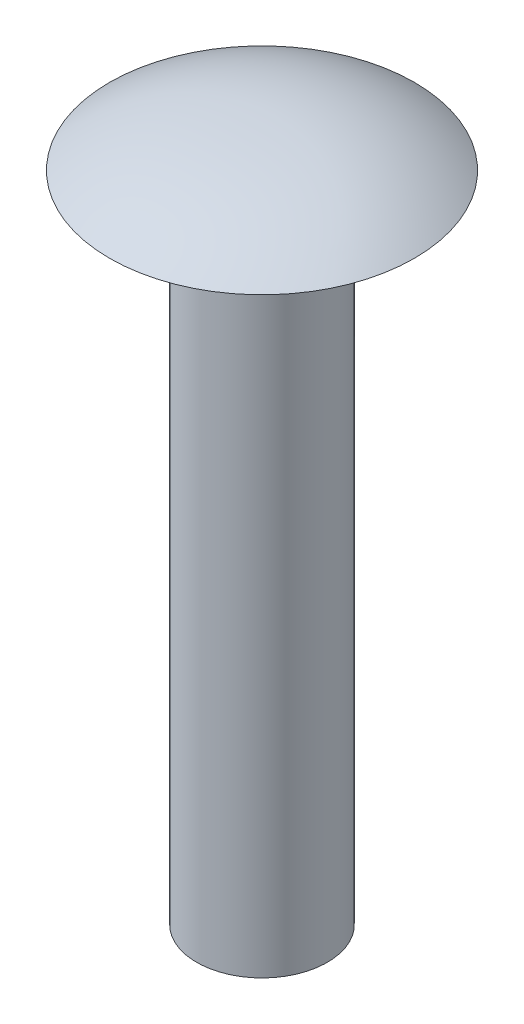
ISO-10303-21;
HEADER;
FILE_DESCRIPTION(('STEP AP214'),'2;1');
FILE_NAME('part.step','',(''),(''),'','','');
FILE_SCHEMA(('AUTOMOTIVE_DESIGN { 1 0 10303 214 1 1 1 1 }'));
ENDSEC;
DATA;
#1=APPLICATION_CONTEXT('core data for automotive mechanical design processes');
#2=APPLICATION_PROTOCOL_DEFINITION('international standard','automotive_design',2000,#1);
#3=PRODUCT_CONTEXT('',#1,'mechanical');
#4=PRODUCT('Part','Part','',(#3));
#5=PRODUCT_RELATED_PRODUCT_CATEGORY('part','',(#4));
#6=PRODUCT_DEFINITION_FORMATION('','',#4);
#7=PRODUCT_DEFINITION_CONTEXT('part definition',#1,'design');
#8=PRODUCT_DEFINITION('design','',#6,#7);
#9=PRODUCT_DEFINITION_SHAPE('','',#8);
#10=(LENGTH_UNIT() NAMED_UNIT(*) SI_UNIT(.MILLI.,.METRE.));
#11=(NAMED_UNIT(*) PLANE_ANGLE_UNIT() SI_UNIT($,.RADIAN.));
#12=(NAMED_UNIT(*) SI_UNIT($,.STERADIAN.) SOLID_ANGLE_UNIT());
#13=UNCERTAINTY_MEASURE_WITH_UNIT(LENGTH_MEASURE(1.E-05),#10,'distance_accuracy_value','');
#14=(GEOMETRIC_REPRESENTATION_CONTEXT(3) GLOBAL_UNCERTAINTY_ASSIGNED_CONTEXT((#13)) GLOBAL_UNIT_ASSIGNED_CONTEXT((#10,
#11,#12)) REPRESENTATION_CONTEXT('',''));
#15=CARTESIAN_POINT('',(0.,0.,0.));
#16=DIRECTION('',(0.,0.,1.));
#17=DIRECTION('',(1.,0.,0.));
#18=AXIS2_PLACEMENT_3D('',#15,#16,#17);
#19=CARTESIAN_POINT('',(0.,0.,0.));
#20=DIRECTION('',(0.,-1.,0.));
#21=DIRECTION('',(0.,0.,-1.));
#22=AXIS2_PLACEMENT_3D('',#19,#20,#21);
#23=PLANE('',#22);
#24=CARTESIAN_POINT('',(0.,0.,0.));
#25=DIRECTION('',(0.,-1.,0.));
#26=DIRECTION('',(0.,0.,-1.));
#27=AXIS2_PLACEMENT_3D('',#24,#25,#26);
#28=CIRCLE('',#27,3.);
#29=CARTESIAN_POINT('',(0.,0.,-3.));
#30=VERTEX_POINT('',#29);
#31=EDGE_CURVE('E13',#30,#30,#28,.T.);
#32=ORIENTED_EDGE('',*,*,#31,.T.);
#33=EDGE_LOOP('',(#32));
#34=FACE_BOUND('',#33,.T.);
#35=ADVANCED_FACE('F44',(#34),#23,.T.);
#36=CARTESIAN_POINT('',(0.,0.,0.));
#37=DIRECTION('',(0.,-1.,0.));
#38=DIRECTION('',(0.,0.,-1.));
#39=AXIS2_PLACEMENT_3D('',#36,#37,#38);
#40=CYLINDRICAL_SURFACE('',#39,3.);
#41=CARTESIAN_POINT('',(0.,30.,0.));
#42=DIRECTION('',(0.,-1.,0.));
#43=DIRECTION('',(0.,0.,-1.));
#44=AXIS2_PLACEMENT_3D('',#41,#42,#43);
#45=CIRCLE('',#44,3.);
#46=CARTESIAN_POINT('',(0.,30.,-3.));
#47=VERTEX_POINT('',#46);
#48=EDGE_CURVE('E50',#47,#47,#45,.T.);
#49=ORIENTED_EDGE('',*,*,#48,.T.);
#50=EDGE_LOOP('',(#49));
#51=FACE_BOUND('',#50,.T.);
#52=ORIENTED_EDGE('',*,*,#31,.F.);
#53=EDGE_LOOP('',(#52));
#54=FACE_BOUND('',#53,.T.);
#55=ADVANCED_FACE('F73',(#51,#54),#40,.T.);
#56=CARTESIAN_POINT('',(3.,30.,0.));
#57=DIRECTION('',(0.,-1.,0.));
#58=DIRECTION('',(0.,0.,-1.));
#59=AXIS2_PLACEMENT_3D('',#56,#57,#58);
#60=PLANE('',#59);
#61=CARTESIAN_POINT('',(0.,30.,0.));
#62=DIRECTION('',(0.,-1.,0.));
#63=DIRECTION('',(0.,0.,-1.));
#64=AXIS2_PLACEMENT_3D('',#61,#62,#63);
#65=CIRCLE('',#64,7.);
#66=CARTESIAN_POINT('',(0.,30.,-7.));
#67=VERTEX_POINT('',#66);
#68=EDGE_CURVE('E60',#67,#67,#65,.T.);
#69=ORIENTED_EDGE('',*,*,#68,.T.);
#70=EDGE_LOOP('',(#69));
#71=FACE_BOUND('',#70,.T.);
#72=ORIENTED_EDGE('',*,*,#48,.F.);
#73=EDGE_LOOP('',(#72));
#74=FACE_BOUND('',#73,.T.);
#75=ADVANCED_FACE('F56',(#71,#74),#60,.T.);
#76=CARTESIAN_POINT('',(7.,30.,0.));
#77=CARTESIAN_POINT('',(4.81559454856268,31.5295371636028,0.));
#78=CARTESIAN_POINT('',(2.66666666666667,32.,0.));
#79=CARTESIAN_POINT('',(0.,32.,0.));
#80=B_SPLINE_CURVE_WITH_KNOTS('',3,(#76,#77,#78,#79),.UNSPECIFIED.,.F.,.F.,(4,4),(0.,1.),.UNSPECIFIED.);
#81=CARTESIAN_POINT('',(0.,0.,0.));
#82=DIRECTION('',(0.,-1.,0.));
#83=AXIS1_PLACEMENT('',#81,#82);
#84=SURFACE_OF_REVOLUTION('',#80,#83);
#85=CARTESIAN_POINT('',(0.,32.,0.));
#86=VERTEX_POINT('',#85);
#87=VERTEX_LOOP('',#86);
#88=FACE_BOUND('',#87,.T.);
#89=ORIENTED_EDGE('',*,*,#68,.F.);
#90=EDGE_LOOP('',(#89));
#91=FACE_BOUND('',#90,.T.);
#92=ADVANCED_FACE('F53',(#88,#91),#84,.F.);
#93=CLOSED_SHELL('',(#35,#55,#75,#92));
#94=MANIFOLD_SOLID_BREP('B2',#93);
#95=ADVANCED_BREP_SHAPE_REPRESENTATION('',(#18,#94),#14);
#96=SHAPE_DEFINITION_REPRESENTATION(#9,#95);
ENDSEC;
END-ISO-10303-21;
